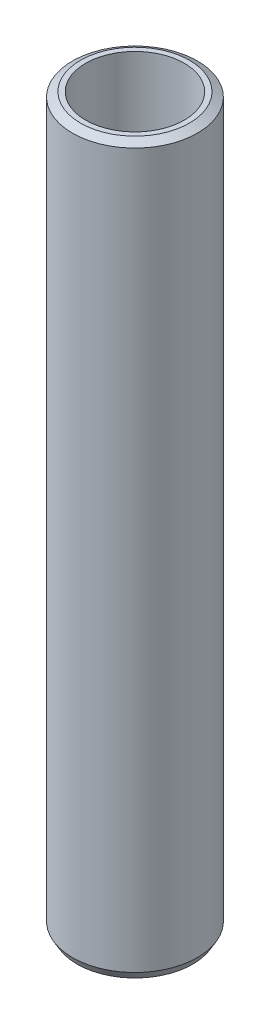
ISO-10303-21;
HEADER;
FILE_DESCRIPTION(('STEP AP214'),'2;1');
FILE_NAME('part.step','',(''),(''),'','','');
FILE_SCHEMA(('AUTOMOTIVE_DESIGN { 1 0 10303 214 1 1 1 1 }'));
ENDSEC;
DATA;
#1=APPLICATION_CONTEXT('core data for automotive mechanical design processes');
#2=APPLICATION_PROTOCOL_DEFINITION('international standard','automotive_design',2000,#1);
#3=PRODUCT_CONTEXT('',#1,'mechanical');
#4=PRODUCT('Part','Part','',(#3));
#5=PRODUCT_RELATED_PRODUCT_CATEGORY('part','',(#4));
#6=PRODUCT_DEFINITION_FORMATION('','',#4);
#7=PRODUCT_DEFINITION_CONTEXT('part definition',#1,'design');
#8=PRODUCT_DEFINITION('design','',#6,#7);
#9=PRODUCT_DEFINITION_SHAPE('','',#8);
#10=(LENGTH_UNIT() NAMED_UNIT(*) SI_UNIT(.MILLI.,.METRE.));
#11=(NAMED_UNIT(*) PLANE_ANGLE_UNIT() SI_UNIT($,.RADIAN.));
#12=(NAMED_UNIT(*) SI_UNIT($,.STERADIAN.) SOLID_ANGLE_UNIT());
#13=UNCERTAINTY_MEASURE_WITH_UNIT(LENGTH_MEASURE(1.E-05),#10,'distance_accuracy_value','');
#14=(GEOMETRIC_REPRESENTATION_CONTEXT(3) GLOBAL_UNCERTAINTY_ASSIGNED_CONTEXT((#13)) GLOBAL_UNIT_ASSIGNED_CONTEXT((#10,
#11,#12)) REPRESENTATION_CONTEXT('',''));
#15=CARTESIAN_POINT('',(0.,0.,0.));
#16=DIRECTION('',(0.,0.,1.));
#17=DIRECTION('',(1.,0.,0.));
#18=AXIS2_PLACEMENT_3D('',#15,#16,#17);
#19=CARTESIAN_POINT('',(0.,435.751842922499,0.));
#20=DIRECTION('',(0.,-1.,0.));
#21=DIRECTION('',(0.,0.,-1.));
#22=AXIS2_PLACEMENT_3D('',#19,#20,#21);
#23=CYLINDRICAL_SURFACE('',#22,37.5);
#24=CARTESIAN_POINT('',(0.,432.964091217651,0.));
#25=DIRECTION('',(0.,1.,0.));
#26=DIRECTION('',(0.,0.,1.));
#27=AXIS2_PLACEMENT_3D('',#24,#25,#26);
#28=CIRCLE('',#27,37.5);
#29=CARTESIAN_POINT('',(0.,432.964091217651,37.5));
#30=VERTEX_POINT('',#29);
#31=EDGE_CURVE('E50',#30,#30,#28,.F.);
#32=ORIENTED_EDGE('',*,*,#31,.T.);
#33=EDGE_LOOP('',(#32));
#34=FACE_BOUND('',#33,.T.);
#35=CARTESIAN_POINT('',(0.,4.82852759168334,0.));
#36=DIRECTION('',(0.,1.,0.));
#37=DIRECTION('',(0.,0.,1.));
#38=AXIS2_PLACEMENT_3D('',#35,#36,#37);
#39=CIRCLE('',#38,37.5);
#40=CARTESIAN_POINT('',(0.,4.82852759168334,37.5));
#41=VERTEX_POINT('',#40);
#42=EDGE_CURVE('E51',#41,#41,#39,.T.);
#43=ORIENTED_EDGE('',*,*,#42,.T.);
#44=EDGE_LOOP('',(#43));
#45=FACE_BOUND('',#44,.T.);
#46=ADVANCED_FACE('F39',(#34,#45),#23,.T.);
#47=CARTESIAN_POINT('',(0.,435.751842922499,0.));
#48=DIRECTION('',(0.,1.,0.));
#49=DIRECTION('',(0.,0.,1.));
#50=AXIS2_PLACEMENT_3D('',#47,#48,#49);
#51=PLANE('',#50);
#52=CARTESIAN_POINT('',(0.,435.751842922499,0.));
#53=DIRECTION('',(0.,1.,0.));
#54=DIRECTION('',(0.,0.,1.));
#55=AXIS2_PLACEMENT_3D('',#52,#53,#54);
#56=CIRCLE('',#55,32.6714724083165);
#57=CARTESIAN_POINT('',(0.,435.751842922499,32.6714724083165));
#58=VERTEX_POINT('',#57);
#59=EDGE_CURVE('E54',#58,#58,#56,.T.);
#60=ORIENTED_EDGE('',*,*,#59,.T.);
#61=EDGE_LOOP('',(#60));
#62=FACE_BOUND('',#61,.T.);
#63=CARTESIAN_POINT('',(0.,435.751842922499,0.));
#64=DIRECTION('',(0.,1.,0.));
#65=DIRECTION('',(0.,0.,1.));
#66=AXIS2_PLACEMENT_3D('',#63,#64,#65);
#67=CIRCLE('',#66,29.5752480229016);
#68=CARTESIAN_POINT('',(0.,435.751842922499,29.5752480229016));
#69=VERTEX_POINT('',#68);
#70=EDGE_CURVE('E58',#69,#69,#67,.T.);
#71=ORIENTED_EDGE('',*,*,#70,.F.);
#72=EDGE_LOOP('',(#71));
#73=FACE_BOUND('',#72,.T.);
#74=ADVANCED_FACE('F69',(#62,#73),#51,.T.);
#75=CARTESIAN_POINT('',(0.,0.,0.));
#76=DIRECTION('',(0.,1.,0.));
#77=DIRECTION('',(0.,0.,1.));
#78=AXIS2_PLACEMENT_3D('',#75,#76,#77);
#79=PLANE('',#78);
#80=CARTESIAN_POINT('',(0.,0.,0.));
#81=DIRECTION('',(0.,1.,0.));
#82=DIRECTION('',(0.,0.,1.));
#83=AXIS2_PLACEMENT_3D('',#80,#81,#82);
#84=CIRCLE('',#83,34.7122482951521);
#85=CARTESIAN_POINT('',(0.,0.,34.7122482951521));
#86=VERTEX_POINT('',#85);
#87=EDGE_CURVE('E10',#86,#86,#84,.F.);
#88=ORIENTED_EDGE('',*,*,#87,.T.);
#89=EDGE_LOOP('',(#88));
#90=FACE_BOUND('',#89,.T.);
#91=CARTESIAN_POINT('',(0.,0.,0.));
#92=DIRECTION('',(0.,1.,0.));
#93=DIRECTION('',(0.,0.,1.));
#94=AXIS2_PLACEMENT_3D('',#91,#92,#93);
#95=CIRCLE('',#94,29.5752480229016);
#96=CARTESIAN_POINT('',(0.,0.,29.5752480229016));
#97=VERTEX_POINT('',#96);
#98=EDGE_CURVE('E63',#97,#97,#95,.T.);
#99=ORIENTED_EDGE('',*,*,#98,.T.);
#100=EDGE_LOOP('',(#99));
#101=FACE_BOUND('',#100,.T.);
#102=ADVANCED_FACE('F75',(#90,#101),#79,.F.);
#103=CARTESIAN_POINT('',(0.,435.751842922499,0.));
#104=DIRECTION('',(0.,-1.,0.));
#105=DIRECTION('',(0.,0.,-1.));
#106=AXIS2_PLACEMENT_3D('',#103,#104,#105);
#107=CYLINDRICAL_SURFACE('',#106,29.5752480229016);
#108=ORIENTED_EDGE('',*,*,#70,.T.);
#109=EDGE_LOOP('',(#108));
#110=FACE_BOUND('',#109,.T.);
#111=ORIENTED_EDGE('',*,*,#98,.F.);
#112=EDGE_LOOP('',(#111));
#113=FACE_BOUND('',#112,.T.);
#114=ADVANCED_FACE('F70',(#110,#113),#107,.F.);
#115=CARTESIAN_POINT('',(0.,435.751842922499,0.));
#116=DIRECTION('',(0.,-1.,0.));
#117=DIRECTION('',(0.,0.,-1.));
#118=AXIS2_PLACEMENT_3D('',#115,#116,#117);
#119=CONICAL_SURFACE('',#118,32.6714724083165,1.04719755119659);
#120=ORIENTED_EDGE('',*,*,#31,.F.);
#121=EDGE_LOOP('',(#120));
#122=FACE_BOUND('',#121,.T.);
#123=ORIENTED_EDGE('',*,*,#59,.F.);
#124=EDGE_LOOP('',(#123));
#125=FACE_BOUND('',#124,.T.);
#126=ADVANCED_FACE('F81',(#122,#125),#119,.T.);
#127=CARTESIAN_POINT('',(0.,4.82852759168334,0.));
#128=DIRECTION('',(0.,1.,0.));
#129=DIRECTION('',(0.,0.,1.));
#130=AXIS2_PLACEMENT_3D('',#127,#128,#129);
#131=CONICAL_SURFACE('',#130,37.5,0.523598775598302);
#132=ORIENTED_EDGE('',*,*,#87,.F.);
#133=EDGE_LOOP('',(#132));
#134=FACE_BOUND('',#133,.T.);
#135=ORIENTED_EDGE('',*,*,#42,.F.);
#136=EDGE_LOOP('',(#135));
#137=FACE_BOUND('',#136,.T.);
#138=ADVANCED_FACE('F45',(#134,#137),#131,.T.);
#139=CLOSED_SHELL('',(#46,#74,#102,#114,#126,#138));
#140=MANIFOLD_SOLID_BREP('B2',#139);
#141=ADVANCED_BREP_SHAPE_REPRESENTATION('',(#18,#140),#14);
#142=SHAPE_DEFINITION_REPRESENTATION(#9,#141);
ENDSEC;
END-ISO-10303-21;
